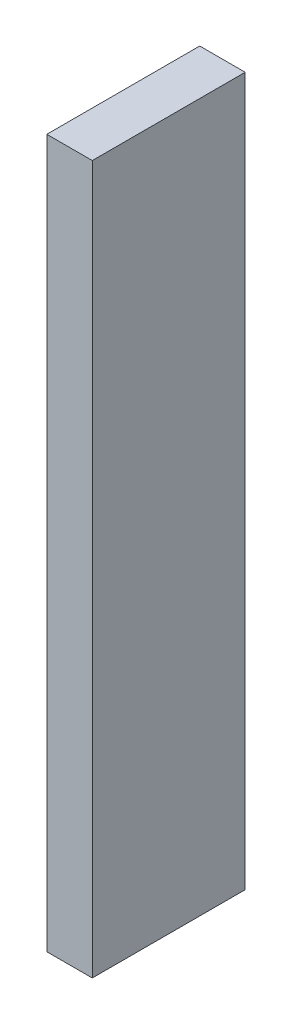
ISO-10303-21;
HEADER;
FILE_DESCRIPTION(('STEP AP214'),'2;1');
FILE_NAME('part.step','',(''),(''),'','','');
FILE_SCHEMA(('AUTOMOTIVE_DESIGN { 1 0 10303 214 1 1 1 1 }'));
ENDSEC;
DATA;
#1=APPLICATION_CONTEXT('core data for automotive mechanical design processes');
#2=APPLICATION_PROTOCOL_DEFINITION('international standard','automotive_design',2000,#1);
#3=PRODUCT_CONTEXT('',#1,'mechanical');
#4=PRODUCT('Part','Part','',(#3));
#5=PRODUCT_RELATED_PRODUCT_CATEGORY('part','',(#4));
#6=PRODUCT_DEFINITION_FORMATION('','',#4);
#7=PRODUCT_DEFINITION_CONTEXT('part definition',#1,'design');
#8=PRODUCT_DEFINITION('design','',#6,#7);
#9=PRODUCT_DEFINITION_SHAPE('','',#8);
#10=(LENGTH_UNIT() NAMED_UNIT(*) SI_UNIT(.MILLI.,.METRE.));
#11=(NAMED_UNIT(*) PLANE_ANGLE_UNIT() SI_UNIT($,.RADIAN.));
#12=(NAMED_UNIT(*) SI_UNIT($,.STERADIAN.) SOLID_ANGLE_UNIT());
#13=UNCERTAINTY_MEASURE_WITH_UNIT(LENGTH_MEASURE(1.E-05),#10,'distance_accuracy_value','');
#14=(GEOMETRIC_REPRESENTATION_CONTEXT(3) GLOBAL_UNCERTAINTY_ASSIGNED_CONTEXT((#13)) GLOBAL_UNIT_ASSIGNED_CONTEXT((#10,
#11,#12)) REPRESENTATION_CONTEXT('',''));
#15=CARTESIAN_POINT('',(0.,0.,0.));
#16=DIRECTION('',(0.,0.,1.));
#17=DIRECTION('',(1.,0.,0.));
#18=AXIS2_PLACEMENT_3D('',#15,#16,#17);
#19=CARTESIAN_POINT('',(130.275545133452,7.11212965552235,132.766083306758));
#20=DIRECTION('',(1.69244514382854E-09,0.,-1.));
#21=DIRECTION('',(-1.,0.,-1.69244514382854E-09));
#22=AXIS2_PLACEMENT_3D('',#19,#20,#21);
#23=PLANE('',#22);
#24=DIRECTION('',(0.,1.,0.));
#25=VECTOR('',#24,1.);
#26=CARTESIAN_POINT('',(131.258630230465,7.11212965552235,132.766083308422));
#27=LINE('',#26,#25);
#28=CARTESIAN_POINT('',(131.258630230465,7.11212965552235,132.766083308422));
#29=VERTEX_POINT('',#28);
#30=CARTESIAN_POINT('',(131.258630230465,22.418070826371,132.766083299961));
#31=VERTEX_POINT('',#30);
#32=EDGE_CURVE('E79',#29,#31,#27,.T.);
#33=ORIENTED_EDGE('',*,*,#32,.F.);
#34=DIRECTION('',(1.,0.,1.69244514382854E-09));
#35=VECTOR('',#34,1.);
#36=CARTESIAN_POINT('',(130.275545133452,7.11212965552235,132.766083306758));
#37=LINE('',#36,#35);
#38=CARTESIAN_POINT('',(130.275545133452,7.11212965552235,132.766083306758));
#39=VERTEX_POINT('',#38);
#40=EDGE_CURVE('E32',#39,#29,#37,.T.);
#41=ORIENTED_EDGE('',*,*,#40,.F.);
#42=DIRECTION('',(0.,1.,0.));
#43=VECTOR('',#42,1.);
#44=CARTESIAN_POINT('',(130.275545133452,7.11212965552235,132.766083306758));
#45=LINE('',#44,#43);
#46=CARTESIAN_POINT('',(130.275545133452,22.418070826371,132.766083298297));
#47=VERTEX_POINT('',#46);
#48=EDGE_CURVE('E71',#39,#47,#45,.T.);
#49=ORIENTED_EDGE('',*,*,#48,.T.);
#50=DIRECTION('',(1.,0.,1.69244514382854E-09));
#51=VECTOR('',#50,1.);
#52=CARTESIAN_POINT('',(130.275545133452,22.418070826371,132.766083298297));
#53=LINE('',#52,#51);
#54=EDGE_CURVE('E10',#47,#31,#53,.T.);
#55=ORIENTED_EDGE('',*,*,#54,.T.);
#56=EDGE_LOOP('',(#33,#41,#49,#55));
#57=FACE_BOUND('',#56,.T.);
#58=ADVANCED_FACE('F16',(#57),#23,.T.);
#59=CARTESIAN_POINT('',(130.275545133452,22.418070826371,132.766083298297));
#60=DIRECTION('',(0.,1.,0.));
#61=DIRECTION('',(-1.,0.,0.));
#62=AXIS2_PLACEMENT_3D('',#59,#60,#61);
#63=PLANE('',#62);
#64=DIRECTION('',(-1.69244514382854E-09,0.,1.));
#65=VECTOR('',#64,1.);
#66=CARTESIAN_POINT('',(131.258630230465,22.418070826371,132.766083299961));
#67=LINE('',#66,#65);
#68=CARTESIAN_POINT('',(131.25863022487,22.4180708263693,136.07202447927));
#69=VERTEX_POINT('',#68);
#70=EDGE_CURVE('E82',#31,#69,#67,.T.);
#71=ORIENTED_EDGE('',*,*,#70,.F.);
#72=ORIENTED_EDGE('',*,*,#54,.F.);
#73=DIRECTION('',(-1.69244514382854E-09,0.,1.));
#74=VECTOR('',#73,1.);
#75=CARTESIAN_POINT('',(130.275545133452,22.418070826371,132.766083298297));
#76=LINE('',#75,#74);
#77=CARTESIAN_POINT('',(130.275545127857,22.4180708263693,136.072024477607));
#78=VERTEX_POINT('',#77);
#79=EDGE_CURVE('E67',#47,#78,#76,.T.);
#80=ORIENTED_EDGE('',*,*,#79,.T.);
#81=DIRECTION('',(1.,0.,1.69244514382854E-09));
#82=VECTOR('',#81,1.);
#83=CARTESIAN_POINT('',(130.275545127857,22.4180708263693,136.072024477607));
#84=LINE('',#83,#82);
#85=EDGE_CURVE('E24',#78,#69,#84,.T.);
#86=ORIENTED_EDGE('',*,*,#85,.T.);
#87=EDGE_LOOP('',(#71,#72,#80,#86));
#88=FACE_BOUND('',#87,.T.);
#89=ADVANCED_FACE('F68',(#88),#63,.T.);
#90=CARTESIAN_POINT('',(130.275545127857,22.4180708263693,136.072024477607));
#91=DIRECTION('',(-1.69244514382854E-09,0.,1.));
#92=DIRECTION('',(1.,0.,1.69244514382854E-09));
#93=AXIS2_PLACEMENT_3D('',#90,#91,#92);
#94=PLANE('',#93);
#95=DIRECTION('',(0.,-1.,0.));
#96=VECTOR('',#95,1.);
#97=CARTESIAN_POINT('',(131.25863022487,22.4180708263693,136.07202447927));
#98=LINE('',#97,#96);
#99=CARTESIAN_POINT('',(131.25863022487,7.11212965552235,136.07202447927));
#100=VERTEX_POINT('',#99);
#101=EDGE_CURVE('E65',#69,#100,#98,.T.);
#102=ORIENTED_EDGE('',*,*,#101,.F.);
#103=ORIENTED_EDGE('',*,*,#85,.F.);
#104=DIRECTION('',(0.,-1.,0.));
#105=VECTOR('',#104,1.);
#106=CARTESIAN_POINT('',(130.275545127857,22.4180708263693,136.072024477607));
#107=LINE('',#106,#105);
#108=CARTESIAN_POINT('',(130.275545127857,7.11212965552235,136.072024477607));
#109=VERTEX_POINT('',#108);
#110=EDGE_CURVE('E62',#78,#109,#107,.T.);
#111=ORIENTED_EDGE('',*,*,#110,.T.);
#112=DIRECTION('',(1.,0.,1.69244514382854E-09));
#113=VECTOR('',#112,1.);
#114=CARTESIAN_POINT('',(130.275545127857,7.11212965552235,136.072024477607));
#115=LINE('',#114,#113);
#116=EDGE_CURVE('E48',#109,#100,#115,.T.);
#117=ORIENTED_EDGE('',*,*,#116,.T.);
#118=EDGE_LOOP('',(#102,#103,#111,#117));
#119=FACE_BOUND('',#118,.T.);
#120=ADVANCED_FACE('F60',(#119),#94,.T.);
#121=CARTESIAN_POINT('',(130.275545127857,7.11212965552235,136.072024477607));
#122=DIRECTION('',(0.,-1.,0.));
#123=DIRECTION('',(0.,0.,-1.));
#124=AXIS2_PLACEMENT_3D('',#121,#122,#123);
#125=PLANE('',#124);
#126=DIRECTION('',(1.69244514382854E-09,0.,-1.));
#127=VECTOR('',#126,1.);
#128=CARTESIAN_POINT('',(131.25863022487,7.11212965552235,136.07202447927));
#129=LINE('',#128,#127);
#130=EDGE_CURVE('E85',#100,#29,#129,.T.);
#131=ORIENTED_EDGE('',*,*,#130,.F.);
#132=ORIENTED_EDGE('',*,*,#116,.F.);
#133=DIRECTION('',(1.69244514382854E-09,0.,-1.));
#134=VECTOR('',#133,1.);
#135=CARTESIAN_POINT('',(130.275545127857,7.11212965552235,136.072024477607));
#136=LINE('',#135,#134);
#137=EDGE_CURVE('E74',#109,#39,#136,.T.);
#138=ORIENTED_EDGE('',*,*,#137,.T.);
#139=ORIENTED_EDGE('',*,*,#40,.T.);
#140=EDGE_LOOP('',(#131,#132,#138,#139));
#141=FACE_BOUND('',#140,.T.);
#142=ADVANCED_FACE('F96',(#141),#125,.T.);
#143=CARTESIAN_POINT('',(130.275545201028,17.2651002409467,92.8378607087388));
#144=DIRECTION('',(1.,0.,1.69244514382854E-09));
#145=DIRECTION('',(0.,1.,0.));
#146=AXIS2_PLACEMENT_3D('',#143,#144,#145);
#147=PLANE('',#146);
#148=ORIENTED_EDGE('',*,*,#48,.F.);
#149=ORIENTED_EDGE('',*,*,#137,.F.);
#150=ORIENTED_EDGE('',*,*,#110,.F.);
#151=ORIENTED_EDGE('',*,*,#79,.F.);
#152=EDGE_LOOP('',(#148,#149,#150,#151));
#153=FACE_BOUND('',#152,.T.);
#154=ADVANCED_FACE('F73',(#153),#147,.F.);
#155=CARTESIAN_POINT('',(131.258630298041,17.2651002409467,92.8378607104026));
#156=DIRECTION('',(1.,0.,1.69244514382854E-09));
#157=DIRECTION('',(0.,1.,0.));
#158=AXIS2_PLACEMENT_3D('',#155,#156,#157);
#159=PLANE('',#158);
#160=ORIENTED_EDGE('',*,*,#32,.T.);
#161=ORIENTED_EDGE('',*,*,#70,.T.);
#162=ORIENTED_EDGE('',*,*,#101,.T.);
#163=ORIENTED_EDGE('',*,*,#130,.T.);
#164=EDGE_LOOP('',(#160,#161,#162,#163));
#165=FACE_BOUND('',#164,.T.);
#166=ADVANCED_FACE('F89',(#165),#159,.T.);
#167=CLOSED_SHELL('',(#58,#89,#120,#142,#154,#166));
#168=MANIFOLD_SOLID_BREP('B1',#167);
#169=ADVANCED_BREP_SHAPE_REPRESENTATION('',(#18,#168),#14);
#170=SHAPE_DEFINITION_REPRESENTATION(#9,#169);
ENDSEC;
END-ISO-10303-21;
